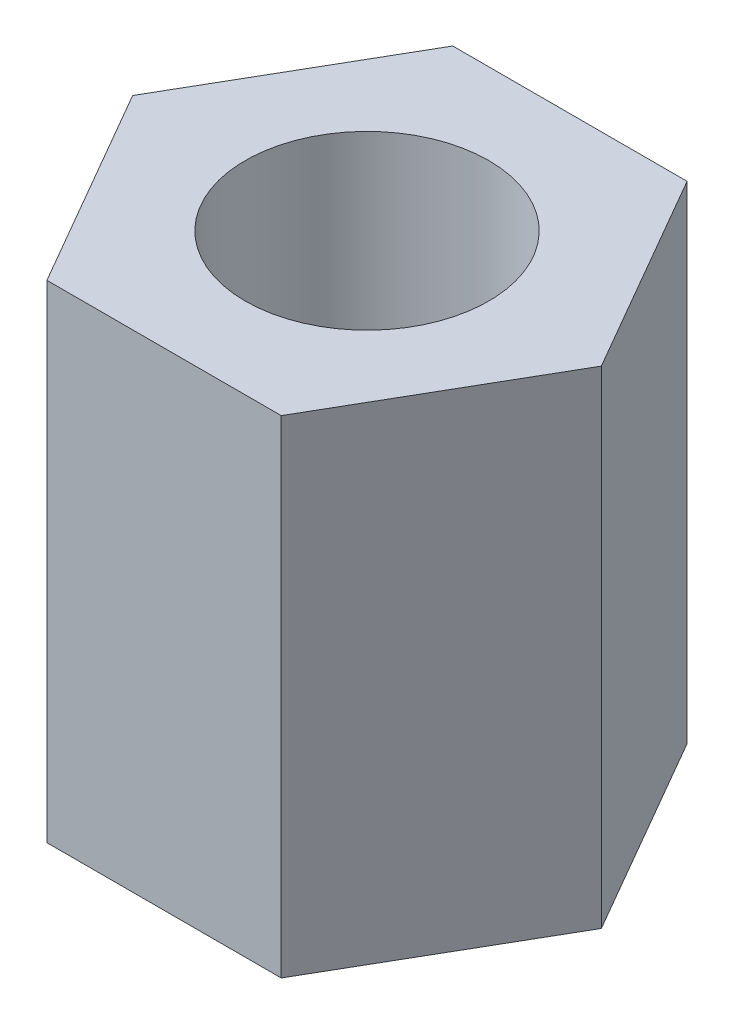
ISO-10303-21;
HEADER;
FILE_DESCRIPTION(('STEP AP214'),'2;1');
FILE_NAME('part.step','',(''),(''),'','','');
FILE_SCHEMA(('AUTOMOTIVE_DESIGN { 1 0 10303 214 1 1 1 1 }'));
ENDSEC;
DATA;
#1=APPLICATION_CONTEXT('core data for automotive mechanical design processes');
#2=APPLICATION_PROTOCOL_DEFINITION('international standard','automotive_design',2000,#1);
#3=PRODUCT_CONTEXT('',#1,'mechanical');
#4=PRODUCT('Part','Part','',(#3));
#5=PRODUCT_RELATED_PRODUCT_CATEGORY('part','',(#4));
#6=PRODUCT_DEFINITION_FORMATION('','',#4);
#7=PRODUCT_DEFINITION_CONTEXT('part definition',#1,'design');
#8=PRODUCT_DEFINITION('design','',#6,#7);
#9=PRODUCT_DEFINITION_SHAPE('','',#8);
#10=(LENGTH_UNIT() NAMED_UNIT(*) SI_UNIT(.MILLI.,.METRE.));
#11=(NAMED_UNIT(*) PLANE_ANGLE_UNIT() SI_UNIT($,.RADIAN.));
#12=(NAMED_UNIT(*) SI_UNIT($,.STERADIAN.) SOLID_ANGLE_UNIT());
#13=UNCERTAINTY_MEASURE_WITH_UNIT(LENGTH_MEASURE(1.E-05),#10,'distance_accuracy_value','');
#14=(GEOMETRIC_REPRESENTATION_CONTEXT(3) GLOBAL_UNCERTAINTY_ASSIGNED_CONTEXT((#13)) GLOBAL_UNIT_ASSIGNED_CONTEXT((#10,
#11,#12)) REPRESENTATION_CONTEXT('',''));
#15=CARTESIAN_POINT('',(0.,0.,0.));
#16=DIRECTION('',(0.,0.,1.));
#17=DIRECTION('',(1.,0.,0.));
#18=AXIS2_PLACEMENT_3D('',#15,#16,#17);
#19=CARTESIAN_POINT('',(0.,3.,0.));
#20=DIRECTION('',(0.,1.,0.));
#21=DIRECTION('',(0.,0.,1.));
#22=AXIS2_PLACEMENT_3D('',#19,#20,#21);
#23=PLANE('',#22);
#24=DIRECTION('',(1.,0.,0.));
#25=VECTOR('',#24,1.);
#26=CARTESIAN_POINT('',(-1.44337567297405,3.,2.5));
#27=LINE('',#26,#25);
#28=CARTESIAN_POINT('',(-1.44337567297405,3.,2.5));
#29=VERTEX_POINT('',#28);
#30=CARTESIAN_POINT('',(1.44337567297408,3.,2.5));
#31=VERTEX_POINT('',#30);
#32=EDGE_CURVE('E129',#29,#31,#27,.T.);
#33=ORIENTED_EDGE('',*,*,#32,.T.);
#34=DIRECTION('',(0.500000000000001,0.,-0.866025403784438));
#35=VECTOR('',#34,1.);
#36=CARTESIAN_POINT('',(1.44337567297408,3.,2.5));
#37=LINE('',#36,#35);
#38=CARTESIAN_POINT('',(2.88675134594815,3.,0.));
#39=VERTEX_POINT('',#38);
#40=EDGE_CURVE('E87',#31,#39,#37,.T.);
#41=ORIENTED_EDGE('',*,*,#40,.T.);
#42=DIRECTION('',(-0.500000000000001,0.,-0.866025403784438));
#43=VECTOR('',#42,1.);
#44=CARTESIAN_POINT('',(2.88675134594815,3.,0.));
#45=LINE('',#44,#43);
#46=CARTESIAN_POINT('',(1.44337567297408,3.,-2.50000000000001));
#47=VERTEX_POINT('',#46);
#48=EDGE_CURVE('E100',#39,#47,#45,.T.);
#49=ORIENTED_EDGE('',*,*,#48,.T.);
#50=DIRECTION('',(-1.,0.,0.));
#51=VECTOR('',#50,1.);
#52=CARTESIAN_POINT('',(1.44337567297408,3.,-2.50000000000001));
#53=LINE('',#52,#51);
#54=CARTESIAN_POINT('',(-1.44337567297405,3.,-2.50000000000001));
#55=VERTEX_POINT('',#54);
#56=EDGE_CURVE('E94',#47,#55,#53,.T.);
#57=ORIENTED_EDGE('',*,*,#56,.T.);
#58=DIRECTION('',(-0.5,0.,0.866025403784438));
#59=VECTOR('',#58,1.);
#60=CARTESIAN_POINT('',(-1.44337567297405,3.,-2.50000000000001));
#61=LINE('',#60,#59);
#62=CARTESIAN_POINT('',(-2.88675134594812,3.,0.));
#63=VERTEX_POINT('',#62);
#64=EDGE_CURVE('E98',#55,#63,#61,.T.);
#65=ORIENTED_EDGE('',*,*,#64,.T.);
#66=DIRECTION('',(0.5,0.,0.866025403784438));
#67=VECTOR('',#66,1.);
#68=CARTESIAN_POINT('',(-2.88675134594812,3.,0.));
#69=LINE('',#68,#67);
#70=EDGE_CURVE('E50',#63,#29,#69,.T.);
#71=ORIENTED_EDGE('',*,*,#70,.T.);
#72=EDGE_LOOP('',(#33,#41,#49,#57,#65,#71));
#73=FACE_BOUND('',#72,.T.);
#74=CARTESIAN_POINT('',(0.,3.,0.));
#75=DIRECTION('',(0.,1.,0.));
#76=DIRECTION('',(0.,0.,1.));
#77=AXIS2_PLACEMENT_3D('',#74,#75,#76);
#78=CIRCLE('',#77,1.5);
#79=CARTESIAN_POINT('',(0.,3.,1.5));
#80=VERTEX_POINT('',#79);
#81=EDGE_CURVE('E122',#80,#80,#78,.T.);
#82=ORIENTED_EDGE('',*,*,#81,.F.);
#83=EDGE_LOOP('',(#82));
#84=FACE_BOUND('',#83,.T.);
#85=ADVANCED_FACE('F33',(#73,#84),#23,.T.);
#86=CARTESIAN_POINT('',(0.,-3.,0.));
#87=DIRECTION('',(0.,1.,0.));
#88=DIRECTION('',(0.,0.,1.));
#89=AXIS2_PLACEMENT_3D('',#86,#87,#88);
#90=PLANE('',#89);
#91=DIRECTION('',(1.,0.,0.));
#92=VECTOR('',#91,1.);
#93=CARTESIAN_POINT('',(-1.44337567297405,-3.,2.5));
#94=LINE('',#93,#92);
#95=CARTESIAN_POINT('',(-1.44337567297405,-3.,2.5));
#96=VERTEX_POINT('',#95);
#97=CARTESIAN_POINT('',(1.44337567297408,-3.,2.5));
#98=VERTEX_POINT('',#97);
#99=EDGE_CURVE('E118',#96,#98,#94,.T.);
#100=ORIENTED_EDGE('',*,*,#99,.F.);
#101=DIRECTION('',(0.5,0.,0.866025403784438));
#102=VECTOR('',#101,1.);
#103=CARTESIAN_POINT('',(-2.88675134594812,-3.,0.));
#104=LINE('',#103,#102);
#105=CARTESIAN_POINT('',(-2.88675134594812,-3.,0.));
#106=VERTEX_POINT('',#105);
#107=EDGE_CURVE('E79',#106,#96,#104,.T.);
#108=ORIENTED_EDGE('',*,*,#107,.F.);
#109=DIRECTION('',(-0.5,0.,0.866025403784438));
#110=VECTOR('',#109,1.);
#111=CARTESIAN_POINT('',(-1.44337567297405,-3.,-2.50000000000001));
#112=LINE('',#111,#110);
#113=CARTESIAN_POINT('',(-1.44337567297405,-3.,-2.50000000000001));
#114=VERTEX_POINT('',#113);
#115=EDGE_CURVE('E73',#114,#106,#112,.T.);
#116=ORIENTED_EDGE('',*,*,#115,.F.);
#117=DIRECTION('',(-1.,0.,0.));
#118=VECTOR('',#117,1.);
#119=CARTESIAN_POINT('',(1.44337567297408,-3.,-2.50000000000001));
#120=LINE('',#119,#118);
#121=CARTESIAN_POINT('',(1.44337567297408,-3.,-2.50000000000001));
#122=VERTEX_POINT('',#121);
#123=EDGE_CURVE('E108',#122,#114,#120,.T.);
#124=ORIENTED_EDGE('',*,*,#123,.F.);
#125=DIRECTION('',(-0.500000000000001,0.,-0.866025403784438));
#126=VECTOR('',#125,1.);
#127=CARTESIAN_POINT('',(2.88675134594815,-3.,0.));
#128=LINE('',#127,#126);
#129=CARTESIAN_POINT('',(2.88675134594815,-3.,0.));
#130=VERTEX_POINT('',#129);
#131=EDGE_CURVE('E124',#130,#122,#128,.T.);
#132=ORIENTED_EDGE('',*,*,#131,.F.);
#133=DIRECTION('',(0.500000000000001,0.,-0.866025403784438));
#134=VECTOR('',#133,1.);
#135=CARTESIAN_POINT('',(1.44337567297408,-3.,2.5));
#136=LINE('',#135,#134);
#137=EDGE_CURVE('E121',#98,#130,#136,.T.);
#138=ORIENTED_EDGE('',*,*,#137,.F.);
#139=EDGE_LOOP('',(#100,#108,#116,#124,#132,#138));
#140=FACE_BOUND('',#139,.T.);
#141=CARTESIAN_POINT('',(0.,-3.,0.));
#142=DIRECTION('',(0.,1.,0.));
#143=DIRECTION('',(0.,0.,1.));
#144=AXIS2_PLACEMENT_3D('',#141,#142,#143);
#145=CIRCLE('',#144,1.5);
#146=CARTESIAN_POINT('',(0.,-3.,1.5));
#147=VERTEX_POINT('',#146);
#148=EDGE_CURVE('E222',#147,#147,#145,.T.);
#149=ORIENTED_EDGE('',*,*,#148,.T.);
#150=EDGE_LOOP('',(#149));
#151=FACE_BOUND('',#150,.T.);
#152=ADVANCED_FACE('F138',(#140,#151),#90,.F.);
#153=CARTESIAN_POINT('',(-1.44337567297405,3.,2.5));
#154=DIRECTION('',(0.,0.,-1.));
#155=DIRECTION('',(-1.,0.,0.));
#156=AXIS2_PLACEMENT_3D('',#153,#154,#155);
#157=PLANE('',#156);
#158=ORIENTED_EDGE('',*,*,#99,.T.);
#159=DIRECTION('',(0.,-1.,0.));
#160=VECTOR('',#159,1.);
#161=CARTESIAN_POINT('',(1.44337567297408,3.,2.5));
#162=LINE('',#161,#160);
#163=EDGE_CURVE('E11',#31,#98,#162,.T.);
#164=ORIENTED_EDGE('',*,*,#163,.F.);
#165=ORIENTED_EDGE('',*,*,#32,.F.);
#166=DIRECTION('',(0.,-1.,0.));
#167=VECTOR('',#166,1.);
#168=CARTESIAN_POINT('',(-1.44337567297405,3.,2.5));
#169=LINE('',#168,#167);
#170=EDGE_CURVE('E114',#29,#96,#169,.T.);
#171=ORIENTED_EDGE('',*,*,#170,.T.);
#172=EDGE_LOOP('',(#158,#164,#165,#171));
#173=FACE_BOUND('',#172,.T.);
#174=ADVANCED_FACE('F35',(#173),#157,.F.);
#175=CARTESIAN_POINT('',(1.44337567297408,3.,2.5));
#176=DIRECTION('',(-0.866025403784438,0.,-0.500000000000001));
#177=DIRECTION('',(-0.500000000000001,0.,0.866025403784438));
#178=AXIS2_PLACEMENT_3D('',#175,#176,#177);
#179=PLANE('',#178);
#180=ORIENTED_EDGE('',*,*,#137,.T.);
#181=DIRECTION('',(0.,-1.,0.));
#182=VECTOR('',#181,1.);
#183=CARTESIAN_POINT('',(2.88675134594815,3.,0.));
#184=LINE('',#183,#182);
#185=EDGE_CURVE('E42',#39,#130,#184,.T.);
#186=ORIENTED_EDGE('',*,*,#185,.F.);
#187=ORIENTED_EDGE('',*,*,#40,.F.);
#188=ORIENTED_EDGE('',*,*,#163,.T.);
#189=EDGE_LOOP('',(#180,#186,#187,#188));
#190=FACE_BOUND('',#189,.T.);
#191=ADVANCED_FACE('F163',(#190),#179,.F.);
#192=CARTESIAN_POINT('',(2.88675134594815,3.,0.));
#193=DIRECTION('',(-0.866025403784438,0.,0.500000000000001));
#194=DIRECTION('',(0.500000000000001,0.,0.866025403784438));
#195=AXIS2_PLACEMENT_3D('',#192,#193,#194);
#196=PLANE('',#195);
#197=ORIENTED_EDGE('',*,*,#131,.T.);
#198=DIRECTION('',(0.,-1.,0.));
#199=VECTOR('',#198,1.);
#200=CARTESIAN_POINT('',(1.44337567297408,3.,-2.50000000000001));
#201=LINE('',#200,#199);
#202=EDGE_CURVE('E109',#47,#122,#201,.T.);
#203=ORIENTED_EDGE('',*,*,#202,.F.);
#204=ORIENTED_EDGE('',*,*,#48,.F.);
#205=ORIENTED_EDGE('',*,*,#185,.T.);
#206=EDGE_LOOP('',(#197,#203,#204,#205));
#207=FACE_BOUND('',#206,.T.);
#208=ADVANCED_FACE('F135',(#207),#196,.F.);
#209=CARTESIAN_POINT('',(1.44337567297408,3.,-2.50000000000001));
#210=DIRECTION('',(0.,0.,1.));
#211=DIRECTION('',(1.,0.,0.));
#212=AXIS2_PLACEMENT_3D('',#209,#210,#211);
#213=PLANE('',#212);
#214=ORIENTED_EDGE('',*,*,#123,.T.);
#215=DIRECTION('',(0.,-1.,0.));
#216=VECTOR('',#215,1.);
#217=CARTESIAN_POINT('',(-1.44337567297405,3.,-2.50000000000001));
#218=LINE('',#217,#216);
#219=EDGE_CURVE('E105',#55,#114,#218,.T.);
#220=ORIENTED_EDGE('',*,*,#219,.F.);
#221=ORIENTED_EDGE('',*,*,#56,.F.);
#222=ORIENTED_EDGE('',*,*,#202,.T.);
#223=EDGE_LOOP('',(#214,#220,#221,#222));
#224=FACE_BOUND('',#223,.T.);
#225=ADVANCED_FACE('F106',(#224),#213,.F.);
#226=CARTESIAN_POINT('',(-1.44337567297405,3.,-2.50000000000001));
#227=DIRECTION('',(0.866025403784439,0.,0.5));
#228=DIRECTION('',(0.5,0.,-0.866025403784439));
#229=AXIS2_PLACEMENT_3D('',#226,#227,#228);
#230=PLANE('',#229);
#231=ORIENTED_EDGE('',*,*,#115,.T.);
#232=DIRECTION('',(0.,-1.,0.));
#233=VECTOR('',#232,1.);
#234=CARTESIAN_POINT('',(-2.88675134594812,3.,0.));
#235=LINE('',#234,#233);
#236=EDGE_CURVE('E110',#63,#106,#235,.T.);
#237=ORIENTED_EDGE('',*,*,#236,.F.);
#238=ORIENTED_EDGE('',*,*,#64,.F.);
#239=ORIENTED_EDGE('',*,*,#219,.T.);
#240=EDGE_LOOP('',(#231,#237,#238,#239));
#241=FACE_BOUND('',#240,.T.);
#242=ADVANCED_FACE('F112',(#241),#230,.F.);
#243=CARTESIAN_POINT('',(-2.88675134594812,3.,0.));
#244=DIRECTION('',(0.866025403784438,0.,-0.500000000000001));
#245=DIRECTION('',(-0.500000000000001,0.,-0.866025403784438));
#246=AXIS2_PLACEMENT_3D('',#243,#244,#245);
#247=PLANE('',#246);
#248=ORIENTED_EDGE('',*,*,#107,.T.);
#249=ORIENTED_EDGE('',*,*,#170,.F.);
#250=ORIENTED_EDGE('',*,*,#70,.F.);
#251=ORIENTED_EDGE('',*,*,#236,.T.);
#252=EDGE_LOOP('',(#248,#249,#250,#251));
#253=FACE_BOUND('',#252,.T.);
#254=ADVANCED_FACE('F143',(#253),#247,.F.);
#255=CARTESIAN_POINT('',(0.,3.,0.));
#256=DIRECTION('',(0.,-1.,0.));
#257=DIRECTION('',(0.,0.,-1.));
#258=AXIS2_PLACEMENT_3D('',#255,#256,#257);
#259=CYLINDRICAL_SURFACE('',#258,1.5);
#260=ORIENTED_EDGE('',*,*,#81,.T.);
#261=EDGE_LOOP('',(#260));
#262=FACE_BOUND('',#261,.T.);
#263=ORIENTED_EDGE('',*,*,#148,.F.);
#264=EDGE_LOOP('',(#263));
#265=FACE_BOUND('',#264,.T.);
#266=ADVANCED_FACE('F145',(#262,#265),#259,.F.);
#267=CLOSED_SHELL('',(#85,#152,#174,#191,#208,#225,#242,#254,#266));
#268=MANIFOLD_SOLID_BREP('B2',#267);
#269=ADVANCED_BREP_SHAPE_REPRESENTATION('',(#18,#268),#14);
#270=SHAPE_DEFINITION_REPRESENTATION(#9,#269);
ENDSEC;
END-ISO-10303-21;
